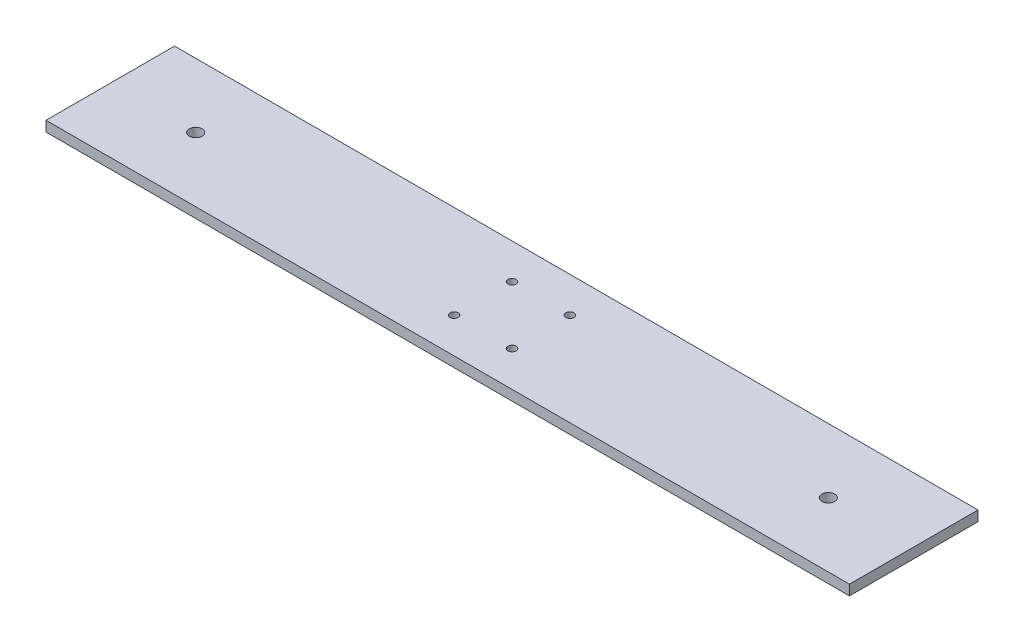
ISO-10303-21;
HEADER;
FILE_DESCRIPTION(('STEP AP214'),'2;1');
FILE_NAME('part.step','',(''),(''),'','','');
FILE_SCHEMA(('AUTOMOTIVE_DESIGN { 1 0 10303 214 1 1 1 1 }'));
ENDSEC;
DATA;
#1=APPLICATION_CONTEXT('core data for automotive mechanical design processes');
#2=APPLICATION_PROTOCOL_DEFINITION('international standard','automotive_design',2000,#1);
#3=PRODUCT_CONTEXT('',#1,'mechanical');
#4=PRODUCT('Part','Part','',(#3));
#5=PRODUCT_RELATED_PRODUCT_CATEGORY('part','',(#4));
#6=PRODUCT_DEFINITION_FORMATION('','',#4);
#7=PRODUCT_DEFINITION_CONTEXT('part definition',#1,'design');
#8=PRODUCT_DEFINITION('design','',#6,#7);
#9=PRODUCT_DEFINITION_SHAPE('','',#8);
#10=(LENGTH_UNIT() NAMED_UNIT(*) SI_UNIT(.MILLI.,.METRE.));
#11=(NAMED_UNIT(*) PLANE_ANGLE_UNIT() SI_UNIT($,.RADIAN.));
#12=(NAMED_UNIT(*) SI_UNIT($,.STERADIAN.) SOLID_ANGLE_UNIT());
#13=UNCERTAINTY_MEASURE_WITH_UNIT(LENGTH_MEASURE(1.E-05),#10,'distance_accuracy_value','');
#14=(GEOMETRIC_REPRESENTATION_CONTEXT(3) GLOBAL_UNCERTAINTY_ASSIGNED_CONTEXT((#13)) GLOBAL_UNIT_ASSIGNED_CONTEXT((#10,
#11,#12)) REPRESENTATION_CONTEXT('',''));
#15=CARTESIAN_POINT('',(0.,0.,0.));
#16=DIRECTION('',(0.,0.,1.));
#17=DIRECTION('',(1.,0.,0.));
#18=AXIS2_PLACEMENT_3D('',#15,#16,#17);
#19=CARTESIAN_POINT('',(0.,3.175,0.));
#20=DIRECTION('',(0.,1.,0.));
#21=DIRECTION('',(0.,0.,1.));
#22=AXIS2_PLACEMENT_3D('',#19,#20,#21);
#23=PLANE('',#22);
#24=CARTESIAN_POINT('',(9.,3.175,9.));
#25=DIRECTION('',(0.,1.,0.));
#26=DIRECTION('',(0.,0.,1.));
#27=AXIS2_PLACEMENT_3D('',#24,#25,#26);
#28=CIRCLE('',#27,1.27299586429724);
#29=CARTESIAN_POINT('',(9.,3.175,10.2729958642972));
#30=VERTEX_POINT('',#29);
#31=EDGE_CURVE('E133',#30,#30,#28,.T.);
#32=ORIENTED_EDGE('',*,*,#31,.F.);
#33=EDGE_LOOP('',(#32));
#34=FACE_BOUND('',#33,.T.);
#35=CARTESIAN_POINT('',(-9.,3.175,-9.));
#36=DIRECTION('',(0.,1.,0.));
#37=DIRECTION('',(0.,0.,1.));
#38=AXIS2_PLACEMENT_3D('',#35,#36,#37);
#39=CIRCLE('',#38,1.27299586429724);
#40=CARTESIAN_POINT('',(-9.,3.175,-7.72700413570276));
#41=VERTEX_POINT('',#40);
#42=EDGE_CURVE('E121',#41,#41,#39,.T.);
#43=ORIENTED_EDGE('',*,*,#42,.F.);
#44=EDGE_LOOP('',(#43));
#45=FACE_BOUND('',#44,.T.);
#46=CARTESIAN_POINT('',(-98.425,3.175,0.));
#47=DIRECTION('',(0.,1.,0.));
#48=DIRECTION('',(0.,0.,1.));
#49=AXIS2_PLACEMENT_3D('',#46,#47,#48);
#50=CIRCLE('',#49,2.);
#51=CARTESIAN_POINT('',(-98.425,3.175,2.));
#52=VERTEX_POINT('',#51);
#53=EDGE_CURVE('E100',#52,#52,#50,.T.);
#54=ORIENTED_EDGE('',*,*,#53,.F.);
#55=EDGE_LOOP('',(#54));
#56=FACE_BOUND('',#55,.T.);
#57=DIRECTION('',(0.,0.,1.));
#58=VECTOR('',#57,1.);
#59=CARTESIAN_POINT('',(-125.,3.175,20.));
#60=LINE('',#59,#58);
#61=CARTESIAN_POINT('',(-125.,3.175,-20.));
#62=VERTEX_POINT('',#61);
#63=CARTESIAN_POINT('',(-125.,3.175,20.));
#64=VERTEX_POINT('',#63);
#65=EDGE_CURVE('E85',#62,#64,#60,.T.);
#66=ORIENTED_EDGE('',*,*,#65,.T.);
#67=DIRECTION('',(1.,0.,0.));
#68=VECTOR('',#67,1.);
#69=CARTESIAN_POINT('',(125.,3.175,20.));
#70=LINE('',#69,#68);
#71=CARTESIAN_POINT('',(125.,3.175,20.));
#72=VERTEX_POINT('',#71);
#73=EDGE_CURVE('E80',#64,#72,#70,.T.);
#74=ORIENTED_EDGE('',*,*,#73,.T.);
#75=DIRECTION('',(0.,0.,-1.));
#76=VECTOR('',#75,1.);
#77=CARTESIAN_POINT('',(125.,3.175,20.));
#78=LINE('',#77,#76);
#79=CARTESIAN_POINT('',(125.,3.175,-20.));
#80=VERTEX_POINT('',#79);
#81=EDGE_CURVE('E83',#72,#80,#78,.T.);
#82=ORIENTED_EDGE('',*,*,#81,.T.);
#83=DIRECTION('',(-1.,0.,0.));
#84=VECTOR('',#83,1.);
#85=CARTESIAN_POINT('',(125.,3.175,-20.));
#86=LINE('',#85,#84);
#87=EDGE_CURVE('E50',#80,#62,#86,.T.);
#88=ORIENTED_EDGE('',*,*,#87,.T.);
#89=EDGE_LOOP('',(#66,#74,#82,#88));
#90=FACE_BOUND('',#89,.T.);
#91=CARTESIAN_POINT('',(98.425,3.175,0.));
#92=DIRECTION('',(0.,1.,0.));
#93=DIRECTION('',(0.,0.,-1.));
#94=AXIS2_PLACEMENT_3D('',#91,#92,#93);
#95=CIRCLE('',#94,2.);
#96=CARTESIAN_POINT('',(98.425,3.175,-2.00000000000002));
#97=VERTEX_POINT('',#96);
#98=EDGE_CURVE('E115',#97,#97,#95,.T.);
#99=ORIENTED_EDGE('',*,*,#98,.F.);
#100=EDGE_LOOP('',(#99));
#101=FACE_BOUND('',#100,.T.);
#102=CARTESIAN_POINT('',(9.,3.175,-9.));
#103=DIRECTION('',(0.,1.,0.));
#104=DIRECTION('',(0.,0.,-1.));
#105=AXIS2_PLACEMENT_3D('',#102,#103,#104);
#106=CIRCLE('',#105,1.27299586429724);
#107=CARTESIAN_POINT('',(9.,3.175,-10.2729958642972));
#108=VERTEX_POINT('',#107);
#109=EDGE_CURVE('E127',#108,#108,#106,.T.);
#110=ORIENTED_EDGE('',*,*,#109,.F.);
#111=EDGE_LOOP('',(#110));
#112=FACE_BOUND('',#111,.T.);
#113=CARTESIAN_POINT('',(-9.,3.175,9.));
#114=DIRECTION('',(0.,1.,0.));
#115=DIRECTION('',(0.,0.,-1.));
#116=AXIS2_PLACEMENT_3D('',#113,#114,#115);
#117=CIRCLE('',#116,1.27299586429724);
#118=CARTESIAN_POINT('',(-9.,3.175,7.72700413570276));
#119=VERTEX_POINT('',#118);
#120=EDGE_CURVE('E139',#119,#119,#117,.T.);
#121=ORIENTED_EDGE('',*,*,#120,.F.);
#122=EDGE_LOOP('',(#121));
#123=FACE_BOUND('',#122,.T.);
#124=ADVANCED_FACE('F33',(#34,#45,#56,#90,#101,#112,#123),#23,.T.);
#125=CARTESIAN_POINT('',(0.,0.,0.));
#126=DIRECTION('',(0.,1.,0.));
#127=DIRECTION('',(0.,0.,1.));
#128=AXIS2_PLACEMENT_3D('',#125,#126,#127);
#129=PLANE('',#128);
#130=CARTESIAN_POINT('',(9.,0.,9.));
#131=DIRECTION('',(0.,1.,0.));
#132=DIRECTION('',(0.,0.,1.));
#133=AXIS2_PLACEMENT_3D('',#130,#131,#132);
#134=CIRCLE('',#133,1.27299586429724);
#135=CARTESIAN_POINT('',(9.,0.,10.2729958642972));
#136=VERTEX_POINT('',#135);
#137=EDGE_CURVE('E136',#136,#136,#134,.T.);
#138=ORIENTED_EDGE('',*,*,#137,.T.);
#139=EDGE_LOOP('',(#138));
#140=FACE_BOUND('',#139,.T.);
#141=CARTESIAN_POINT('',(-9.,0.,-9.));
#142=DIRECTION('',(0.,1.,0.));
#143=DIRECTION('',(0.,0.,1.));
#144=AXIS2_PLACEMENT_3D('',#141,#142,#143);
#145=CIRCLE('',#144,1.27299586429724);
#146=CARTESIAN_POINT('',(-9.,0.,-7.72700413570276));
#147=VERTEX_POINT('',#146);
#148=EDGE_CURVE('E124',#147,#147,#145,.T.);
#149=ORIENTED_EDGE('',*,*,#148,.T.);
#150=EDGE_LOOP('',(#149));
#151=FACE_BOUND('',#150,.T.);
#152=CARTESIAN_POINT('',(-98.425,0.,0.));
#153=DIRECTION('',(0.,1.,0.));
#154=DIRECTION('',(0.,0.,1.));
#155=AXIS2_PLACEMENT_3D('',#152,#153,#154);
#156=CIRCLE('',#155,2.);
#157=CARTESIAN_POINT('',(-98.425,0.,2.));
#158=VERTEX_POINT('',#157);
#159=EDGE_CURVE('E112',#158,#158,#156,.T.);
#160=ORIENTED_EDGE('',*,*,#159,.T.);
#161=EDGE_LOOP('',(#160));
#162=FACE_BOUND('',#161,.T.);
#163=DIRECTION('',(0.,0.,1.));
#164=VECTOR('',#163,1.);
#165=CARTESIAN_POINT('',(-125.,0.,20.));
#166=LINE('',#165,#164);
#167=CARTESIAN_POINT('',(-125.,0.,-20.));
#168=VERTEX_POINT('',#167);
#169=CARTESIAN_POINT('',(-125.,0.,20.));
#170=VERTEX_POINT('',#169);
#171=EDGE_CURVE('E97',#168,#170,#166,.T.);
#172=ORIENTED_EDGE('',*,*,#171,.F.);
#173=DIRECTION('',(-1.,0.,0.));
#174=VECTOR('',#173,1.);
#175=CARTESIAN_POINT('',(125.,0.,-20.));
#176=LINE('',#175,#174);
#177=CARTESIAN_POINT('',(125.,0.,-20.));
#178=VERTEX_POINT('',#177);
#179=EDGE_CURVE('E73',#178,#168,#176,.T.);
#180=ORIENTED_EDGE('',*,*,#179,.F.);
#181=DIRECTION('',(0.,0.,-1.));
#182=VECTOR('',#181,1.);
#183=CARTESIAN_POINT('',(125.,0.,20.));
#184=LINE('',#183,#182);
#185=CARTESIAN_POINT('',(125.,0.,20.));
#186=VERTEX_POINT('',#185);
#187=EDGE_CURVE('E67',#186,#178,#184,.T.);
#188=ORIENTED_EDGE('',*,*,#187,.F.);
#189=DIRECTION('',(1.,0.,0.));
#190=VECTOR('',#189,1.);
#191=CARTESIAN_POINT('',(125.,0.,20.));
#192=LINE('',#191,#190);
#193=EDGE_CURVE('E89',#170,#186,#192,.T.);
#194=ORIENTED_EDGE('',*,*,#193,.F.);
#195=EDGE_LOOP('',(#172,#180,#188,#194));
#196=FACE_BOUND('',#195,.T.);
#197=CARTESIAN_POINT('',(98.425,0.,0.));
#198=DIRECTION('',(0.,1.,0.));
#199=DIRECTION('',(0.,0.,-1.));
#200=AXIS2_PLACEMENT_3D('',#197,#198,#199);
#201=CIRCLE('',#200,2.);
#202=CARTESIAN_POINT('',(98.425,0.,-2.00000000000002));
#203=VERTEX_POINT('',#202);
#204=EDGE_CURVE('E118',#203,#203,#201,.T.);
#205=ORIENTED_EDGE('',*,*,#204,.T.);
#206=EDGE_LOOP('',(#205));
#207=FACE_BOUND('',#206,.T.);
#208=CARTESIAN_POINT('',(9.,0.,-9.));
#209=DIRECTION('',(0.,1.,0.));
#210=DIRECTION('',(0.,0.,-1.));
#211=AXIS2_PLACEMENT_3D('',#208,#209,#210);
#212=CIRCLE('',#211,1.27299586429724);
#213=CARTESIAN_POINT('',(9.,0.,-10.2729958642972));
#214=VERTEX_POINT('',#213);
#215=EDGE_CURVE('E130',#214,#214,#212,.T.);
#216=ORIENTED_EDGE('',*,*,#215,.T.);
#217=EDGE_LOOP('',(#216));
#218=FACE_BOUND('',#217,.T.);
#219=CARTESIAN_POINT('',(-9.,0.,9.));
#220=DIRECTION('',(0.,1.,0.));
#221=DIRECTION('',(0.,0.,-1.));
#222=AXIS2_PLACEMENT_3D('',#219,#220,#221);
#223=CIRCLE('',#222,1.27299586429724);
#224=CARTESIAN_POINT('',(-9.,0.,7.72700413570276));
#225=VERTEX_POINT('',#224);
#226=EDGE_CURVE('E142',#225,#225,#223,.T.);
#227=ORIENTED_EDGE('',*,*,#226,.T.);
#228=EDGE_LOOP('',(#227));
#229=FACE_BOUND('',#228,.T.);
#230=ADVANCED_FACE('F108',(#140,#151,#162,#196,#207,#218,#229),#129,.F.);
#231=CARTESIAN_POINT('',(-125.,3.175,20.));
#232=DIRECTION('',(1.,0.,0.));
#233=DIRECTION('',(0.,0.,-1.));
#234=AXIS2_PLACEMENT_3D('',#231,#232,#233);
#235=PLANE('',#234);
#236=ORIENTED_EDGE('',*,*,#171,.T.);
#237=DIRECTION('',(0.,-1.,0.));
#238=VECTOR('',#237,1.);
#239=CARTESIAN_POINT('',(-125.,3.175,20.));
#240=LINE('',#239,#238);
#241=EDGE_CURVE('E11',#64,#170,#240,.T.);
#242=ORIENTED_EDGE('',*,*,#241,.F.);
#243=ORIENTED_EDGE('',*,*,#65,.F.);
#244=DIRECTION('',(0.,-1.,0.));
#245=VECTOR('',#244,1.);
#246=CARTESIAN_POINT('',(-125.,3.175,-20.));
#247=LINE('',#246,#245);
#248=EDGE_CURVE('E93',#62,#168,#247,.T.);
#249=ORIENTED_EDGE('',*,*,#248,.T.);
#250=EDGE_LOOP('',(#236,#242,#243,#249));
#251=FACE_BOUND('',#250,.T.);
#252=ADVANCED_FACE('F35',(#251),#235,.F.);
#253=CARTESIAN_POINT('',(125.,3.175,20.));
#254=DIRECTION('',(0.,0.,-1.));
#255=DIRECTION('',(-1.,0.,0.));
#256=AXIS2_PLACEMENT_3D('',#253,#254,#255);
#257=PLANE('',#256);
#258=ORIENTED_EDGE('',*,*,#193,.T.);
#259=DIRECTION('',(0.,-1.,0.));
#260=VECTOR('',#259,1.);
#261=CARTESIAN_POINT('',(125.,3.175,20.));
#262=LINE('',#261,#260);
#263=EDGE_CURVE('E42',#72,#186,#262,.T.);
#264=ORIENTED_EDGE('',*,*,#263,.F.);
#265=ORIENTED_EDGE('',*,*,#73,.F.);
#266=ORIENTED_EDGE('',*,*,#241,.T.);
#267=EDGE_LOOP('',(#258,#264,#265,#266));
#268=FACE_BOUND('',#267,.T.);
#269=ADVANCED_FACE('F88',(#268),#257,.F.);
#270=CARTESIAN_POINT('',(125.,3.175,20.));
#271=DIRECTION('',(-1.,0.,0.));
#272=DIRECTION('',(0.,0.,1.));
#273=AXIS2_PLACEMENT_3D('',#270,#271,#272);
#274=PLANE('',#273);
#275=ORIENTED_EDGE('',*,*,#187,.T.);
#276=DIRECTION('',(0.,-1.,0.));
#277=VECTOR('',#276,1.);
#278=CARTESIAN_POINT('',(125.,3.175,-20.));
#279=LINE('',#278,#277);
#280=EDGE_CURVE('E90',#80,#178,#279,.T.);
#281=ORIENTED_EDGE('',*,*,#280,.F.);
#282=ORIENTED_EDGE('',*,*,#81,.F.);
#283=ORIENTED_EDGE('',*,*,#263,.T.);
#284=EDGE_LOOP('',(#275,#281,#282,#283));
#285=FACE_BOUND('',#284,.T.);
#286=ADVANCED_FACE('F91',(#285),#274,.F.);
#287=CARTESIAN_POINT('',(125.,3.175,-20.));
#288=DIRECTION('',(0.,0.,1.));
#289=DIRECTION('',(1.,0.,0.));
#290=AXIS2_PLACEMENT_3D('',#287,#288,#289);
#291=PLANE('',#290);
#292=ORIENTED_EDGE('',*,*,#179,.T.);
#293=ORIENTED_EDGE('',*,*,#248,.F.);
#294=ORIENTED_EDGE('',*,*,#87,.F.);
#295=ORIENTED_EDGE('',*,*,#280,.T.);
#296=EDGE_LOOP('',(#292,#293,#294,#295));
#297=FACE_BOUND('',#296,.T.);
#298=ADVANCED_FACE('F105',(#297),#291,.F.);
#299=CARTESIAN_POINT('',(-98.425,3.175,0.));
#300=DIRECTION('',(0.,-1.,0.));
#301=DIRECTION('',(0.,0.,-1.));
#302=AXIS2_PLACEMENT_3D('',#299,#300,#301);
#303=CYLINDRICAL_SURFACE('',#302,2.);
#304=ORIENTED_EDGE('',*,*,#53,.T.);
#305=EDGE_LOOP('',(#304));
#306=FACE_BOUND('',#305,.T.);
#307=ORIENTED_EDGE('',*,*,#159,.F.);
#308=EDGE_LOOP('',(#307));
#309=FACE_BOUND('',#308,.T.);
#310=ADVANCED_FACE('F162',(#306,#309),#303,.F.);
#311=CARTESIAN_POINT('',(98.425,3.175,0.));
#312=DIRECTION('',(0.,-1.,0.));
#313=DIRECTION('',(0.,0.,-1.));
#314=AXIS2_PLACEMENT_3D('',#311,#312,#313);
#315=CYLINDRICAL_SURFACE('',#314,2.);
#316=ORIENTED_EDGE('',*,*,#98,.T.);
#317=EDGE_LOOP('',(#316));
#318=FACE_BOUND('',#317,.T.);
#319=ORIENTED_EDGE('',*,*,#204,.F.);
#320=EDGE_LOOP('',(#319));
#321=FACE_BOUND('',#320,.T.);
#322=ADVANCED_FACE('F208',(#318,#321),#315,.F.);
#323=CARTESIAN_POINT('',(-9.,3.175,-9.));
#324=DIRECTION('',(0.,-1.,0.));
#325=DIRECTION('',(0.,0.,-1.));
#326=AXIS2_PLACEMENT_3D('',#323,#324,#325);
#327=CYLINDRICAL_SURFACE('',#326,1.27299586429724);
#328=ORIENTED_EDGE('',*,*,#42,.T.);
#329=EDGE_LOOP('',(#328));
#330=FACE_BOUND('',#329,.T.);
#331=ORIENTED_EDGE('',*,*,#148,.F.);
#332=EDGE_LOOP('',(#331));
#333=FACE_BOUND('',#332,.T.);
#334=ADVANCED_FACE('F216',(#330,#333),#327,.F.);
#335=CARTESIAN_POINT('',(9.,3.175,-9.));
#336=DIRECTION('',(0.,-1.,0.));
#337=DIRECTION('',(0.,0.,-1.));
#338=AXIS2_PLACEMENT_3D('',#335,#336,#337);
#339=CYLINDRICAL_SURFACE('',#338,1.27299586429724);
#340=ORIENTED_EDGE('',*,*,#109,.T.);
#341=EDGE_LOOP('',(#340));
#342=FACE_BOUND('',#341,.T.);
#343=ORIENTED_EDGE('',*,*,#215,.F.);
#344=EDGE_LOOP('',(#343));
#345=FACE_BOUND('',#344,.T.);
#346=ADVANCED_FACE('F224',(#342,#345),#339,.F.);
#347=CARTESIAN_POINT('',(9.,3.175,9.));
#348=DIRECTION('',(0.,-1.,0.));
#349=DIRECTION('',(0.,0.,-1.));
#350=AXIS2_PLACEMENT_3D('',#347,#348,#349);
#351=CYLINDRICAL_SURFACE('',#350,1.27299586429724);
#352=ORIENTED_EDGE('',*,*,#31,.T.);
#353=EDGE_LOOP('',(#352));
#354=FACE_BOUND('',#353,.T.);
#355=ORIENTED_EDGE('',*,*,#137,.F.);
#356=EDGE_LOOP('',(#355));
#357=FACE_BOUND('',#356,.T.);
#358=ADVANCED_FACE('F233',(#354,#357),#351,.F.);
#359=CARTESIAN_POINT('',(-9.,3.175,9.));
#360=DIRECTION('',(0.,-1.,0.));
#361=DIRECTION('',(0.,0.,-1.));
#362=AXIS2_PLACEMENT_3D('',#359,#360,#361);
#363=CYLINDRICAL_SURFACE('',#362,1.27299586429724);
#364=ORIENTED_EDGE('',*,*,#120,.T.);
#365=EDGE_LOOP('',(#364));
#366=FACE_BOUND('',#365,.T.);
#367=ORIENTED_EDGE('',*,*,#226,.F.);
#368=EDGE_LOOP('',(#367));
#369=FACE_BOUND('',#368,.T.);
#370=ADVANCED_FACE('F148',(#366,#369),#363,.F.);
#371=CLOSED_SHELL('',(#124,#230,#252,#269,#286,#298,#310,#322,#334,#346,#358,#370));
#372=MANIFOLD_SOLID_BREP('B2',#371);
#373=ADVANCED_BREP_SHAPE_REPRESENTATION('',(#18,#372),#14);
#374=SHAPE_DEFINITION_REPRESENTATION(#9,#373);
ENDSEC;
END-ISO-10303-21;
